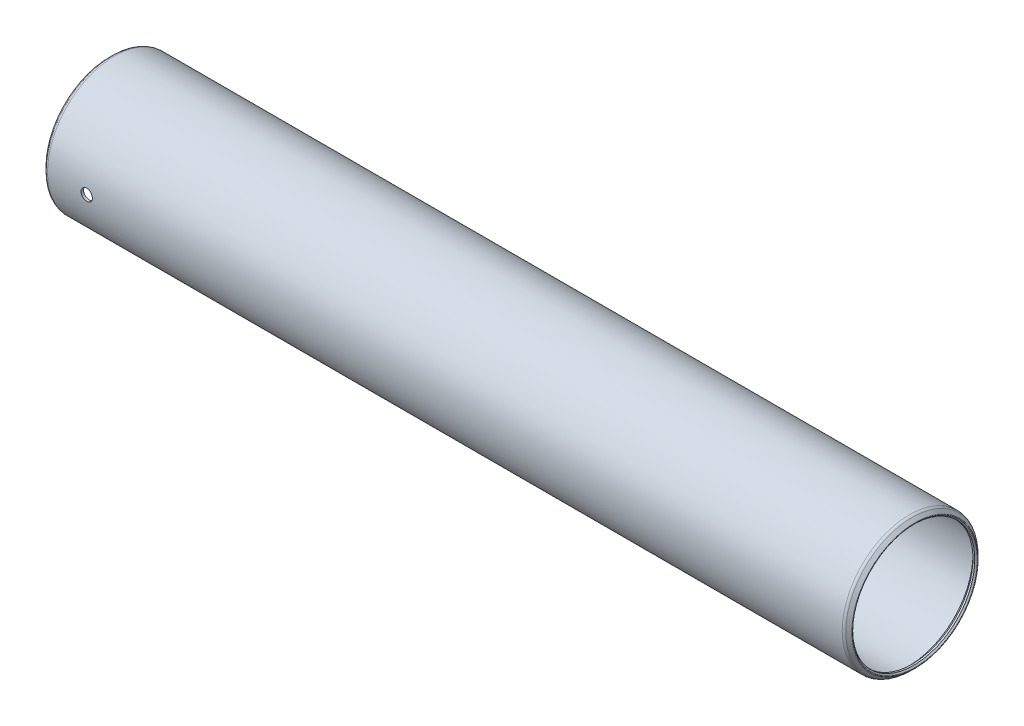
ISO-10303-21;
HEADER;
FILE_DESCRIPTION(('STEP AP214'),'2;1');
FILE_NAME('part.step','',(''),(''),'','','');
FILE_SCHEMA(('AUTOMOTIVE_DESIGN { 1 0 10303 214 1 1 1 1 }'));
ENDSEC;
DATA;
#1=APPLICATION_CONTEXT('core data for automotive mechanical design processes');
#2=APPLICATION_PROTOCOL_DEFINITION('international standard','automotive_design',2000,#1);
#3=PRODUCT_CONTEXT('',#1,'mechanical');
#4=PRODUCT('Part','Part','',(#3));
#5=PRODUCT_RELATED_PRODUCT_CATEGORY('part','',(#4));
#6=PRODUCT_DEFINITION_FORMATION('','',#4);
#7=PRODUCT_DEFINITION_CONTEXT('part definition',#1,'design');
#8=PRODUCT_DEFINITION('design','',#6,#7);
#9=PRODUCT_DEFINITION_SHAPE('','',#8);
#10=(LENGTH_UNIT() NAMED_UNIT(*) SI_UNIT(.MILLI.,.METRE.));
#11=(NAMED_UNIT(*) PLANE_ANGLE_UNIT() SI_UNIT($,.RADIAN.));
#12=(NAMED_UNIT(*) SI_UNIT($,.STERADIAN.) SOLID_ANGLE_UNIT());
#13=UNCERTAINTY_MEASURE_WITH_UNIT(LENGTH_MEASURE(1.E-05),#10,'distance_accuracy_value','');
#14=(GEOMETRIC_REPRESENTATION_CONTEXT(3) GLOBAL_UNCERTAINTY_ASSIGNED_CONTEXT((#13)) GLOBAL_UNIT_ASSIGNED_CONTEXT((#10,
#11,#12)) REPRESENTATION_CONTEXT('',''));
#15=CARTESIAN_POINT('',(0.,0.,0.));
#16=DIRECTION('',(0.,0.,1.));
#17=DIRECTION('',(1.,0.,0.));
#18=AXIS2_PLACEMENT_3D('',#15,#16,#17);
#19=CARTESIAN_POINT('',(168.1734,0.,0.));
#20=DIRECTION('',(-1.,0.,0.));
#21=DIRECTION('',(0.,0.,1.));
#22=AXIS2_PLACEMENT_3D('',#19,#20,#21);
#23=CYLINDRICAL_SURFACE('',#22,13.60805);
#24=CARTESIAN_POINT('',(0.762000000000013,0.,0.));
#25=DIRECTION('',(-1.,0.,0.));
#26=DIRECTION('',(0.,0.,1.));
#27=AXIS2_PLACEMENT_3D('',#24,#25,#26);
#28=CIRCLE('',#27,13.60805);
#29=CARTESIAN_POINT('',(0.762000000000013,0.,13.60805));
#30=VERTEX_POINT('',#29);
#31=EDGE_CURVE('E56',#30,#30,#28,.T.);
#32=ORIENTED_EDGE('',*,*,#31,.T.);
#33=EDGE_LOOP('',(#32));
#34=FACE_BOUND('',#33,.T.);
#35=CARTESIAN_POINT('',(167.4114,0.,0.));
#36=DIRECTION('',(-1.,0.,0.));
#37=DIRECTION('',(0.,0.,1.));
#38=AXIS2_PLACEMENT_3D('',#35,#36,#37);
#39=CIRCLE('',#38,13.60805);
#40=CARTESIAN_POINT('',(167.4114,0.,13.60805));
#41=VERTEX_POINT('',#40);
#42=EDGE_CURVE('E59',#41,#41,#39,.T.);
#43=ORIENTED_EDGE('',*,*,#42,.F.);
#44=EDGE_LOOP('',(#43));
#45=FACE_BOUND('',#44,.T.);
#46=CARTESIAN_POINT('',(9.95679999999999,0.,13.60805));
#47=CARTESIAN_POINT('',(9.95679708301893,-0.0669182546482718,13.608049316548));
#48=CARTESIAN_POINT('',(9.95115443233959,-0.133881741871162,13.6075511313661));
#49=CARTESIAN_POINT('',(9.92872838455429,-0.265955050546539,13.6056116722791));
#50=CARTESIAN_POINT('',(9.91193245128793,-0.331062700079983,13.6041693371863));
#51=CARTESIAN_POINT('',(9.8676900846028,-0.457492452892775,13.600504525612));
#52=CARTESIAN_POINT('',(9.84024977771192,-0.518816710269826,13.5982824979641));
#53=CARTESIAN_POINT('',(9.77550878988491,-0.635974564806711,13.5933073106333));
#54=CARTESIAN_POINT('',(9.73821018149235,-0.691809312663339,13.5905542626213));
#55=CARTESIAN_POINT('',(9.65469848449648,-0.7965743137312,13.5848171871262));
#56=CARTESIAN_POINT('',(9.60846341826353,-0.845487018835931,13.5818326012789));
#57=CARTESIAN_POINT('',(9.50843782103866,-0.934868846378991,13.5759734995207));
#58=CARTESIAN_POINT('',(9.4546469541021,-0.975337593184628,13.5730989885111));
#59=CARTESIAN_POINT('',(9.34092941918919,-1.04674292044388,13.5677795828556));
#60=CARTESIAN_POINT('',(9.280992951096,-1.07766395049416,13.565335391827));
#61=CARTESIAN_POINT('',(9.1567538010192,-1.12899678917914,13.5611599143374));
#62=CARTESIAN_POINT('',(9.09245120371227,-1.14940880155976,13.5594286140552));
#63=CARTESIAN_POINT('',(8.96148184852376,-1.17909296626753,13.5568797393416));
#64=CARTESIAN_POINT('',(8.8948216509038,-1.18839385737639,13.5560598080495));
#65=CARTESIAN_POINT('',(8.76088164230416,-1.19568055751461,13.5554190966986));
#66=CARTESIAN_POINT('',(8.69360184412538,-1.19366659978648,13.555598296044));
#67=CARTESIAN_POINT('',(8.56052969101664,-1.17840450616186,13.5569334538123));
#68=CARTESIAN_POINT('',(8.49473371875241,-1.16518763914177,13.5580866935214));
#69=CARTESIAN_POINT('',(8.36629761654667,-1.12794350298004,13.5612357313031));
#70=CARTESIAN_POINT('',(8.30365752035618,-1.10391611825092,13.5632315383846));
#71=CARTESIAN_POINT('',(8.18321185861607,-1.04569810788095,13.5678439633093));
#72=CARTESIAN_POINT('',(8.12541308946077,-1.0114934917358,13.5704614347403));
#73=CARTESIAN_POINT('',(8.01636511195066,-0.933902039337988,13.5760214947568));
#74=CARTESIAN_POINT('',(7.96511605083599,-0.890514996718806,13.5789640906484));
#75=CARTESIAN_POINT('',(7.87044047693493,-0.795615092475709,13.5848549435303));
#76=CARTESIAN_POINT('',(7.82704104819841,-0.744075205315693,13.5878031859359));
#77=CARTESIAN_POINT('',(7.74950622419902,-0.634426816025969,13.5933636651988));
#78=CARTESIAN_POINT('',(7.71537083604385,-0.576318308856631,13.5959759017984));
#79=CARTESIAN_POINT('',(7.65733461000234,-0.455164276524883,13.6005706231754));
#80=CARTESIAN_POINT('',(7.63343501463544,-0.392118153085045,13.6025530314905));
#81=CARTESIAN_POINT('',(7.5965679764888,-0.262886805098121,13.6056638839094));
#82=CARTESIAN_POINT('',(7.58360028224248,-0.19670165279513,13.6067923476564));
#83=CARTESIAN_POINT('',(7.56899920769066,-0.0633057084379337,13.6080656427365));
#84=CARTESIAN_POINT('',(7.5673284262197,0.00390096014763285,13.6082137198431));
#85=CARTESIAN_POINT('',(7.57527056376644,0.137638382320868,13.6075182347554));
#86=CARTESIAN_POINT('',(7.58488336595981,0.204169142899341,13.6066746828279));
#87=CARTESIAN_POINT('',(7.61508879198431,0.334559219682892,13.6040928727499));
#88=CARTESIAN_POINT('',(7.63566403643894,0.398422592305757,13.6023560309328));
#89=CARTESIAN_POINT('',(7.68719251361759,0.521790806302529,13.5981826863816));
#90=CARTESIAN_POINT('',(7.71814592753115,0.581295571558635,13.5957461714322));
#91=CARTESIAN_POINT('',(7.78964577513802,0.694427383789486,13.5904383750868));
#92=CARTESIAN_POINT('',(7.83021693615533,0.748038749909508,13.5875659800053));
#93=CARTESIAN_POINT('',(7.91976495742896,0.847703536830346,13.5817127326722));
#94=CARTESIAN_POINT('',(7.96874197958377,0.893756812027454,13.5787318783325));
#95=CARTESIAN_POINT('',(8.07387396535874,0.977126813007208,13.5729880250846));
#96=CARTESIAN_POINT('',(8.13004834977849,1.01441909752546,13.5702256495799));
#97=CARTESIAN_POINT('',(8.24788402429577,1.07904083433481,13.5652405289984));
#98=CARTESIAN_POINT('',(8.30954525454217,1.10637039528381,13.5630177780363));
#99=CARTESIAN_POINT('',(8.43651841293467,1.15024944112672,13.559367185593));
#100=CARTESIAN_POINT('',(8.50182517357792,1.1668137844106,13.5579382488695));
#101=CARTESIAN_POINT('',(8.63430609227215,1.18874053042524,13.5560334832072));
#102=CARTESIAN_POINT('',(8.70148021010278,1.19410317423634,13.5555576337563));
#103=CARTESIAN_POINT('',(8.83554611693338,1.19347137557144,13.5556132553957));
#104=CARTESIAN_POINT('',(8.90243809165198,1.18751533298986,13.5561413205969));
#105=CARTESIAN_POINT('',(9.03426766120116,1.1644954120055,13.5581380294439));
#106=CARTESIAN_POINT('',(9.09920525322321,1.14743151764102,13.5596066744412));
#107=CARTESIAN_POINT('',(9.22528451287958,1.10269022427221,13.5633181559878));
#108=CARTESIAN_POINT('',(9.2864264674737,1.07501362875311,13.5655609339264));
#109=CARTESIAN_POINT('',(9.40320259425023,1.00983676557016,13.5705680835019));
#110=CARTESIAN_POINT('',(9.45883683910169,0.972336627542543,13.5733324482555));
#111=CARTESIAN_POINT('',(9.56321493671497,0.888432807982477,13.5790824775698));
#112=CARTESIAN_POINT('',(9.61193584490628,0.842000630023597,13.5820688311231));
#113=CARTESIAN_POINT('',(9.70091338867967,0.741603984891418,13.5879200468851));
#114=CARTESIAN_POINT('',(9.74116797861839,0.6876377025462,13.5907848795984));
#115=CARTESIAN_POINT('',(9.81213036633629,0.573589955763267,13.5960759911951));
#116=CARTESIAN_POINT('',(9.84281871286696,0.513496357359421,13.5985013723954));
#117=CARTESIAN_POINT('',(9.89362986284665,0.389028363158872,13.6026300080547));
#118=CARTESIAN_POINT('',(9.91376475422052,0.324658960547063,13.6043340882591));
#119=CARTESIAN_POINT('',(9.93779579646115,0.216594595648881,13.6063929318442));
#120=CARTESIAN_POINT('',(9.94491283573995,0.17359363107121,13.6070114866693));
#121=CARTESIAN_POINT('',(9.95441587945564,0.0870681605825597,13.6078402424959));
#122=CARTESIAN_POINT('',(9.95680189807731,0.0435436562416746,13.6080504447217));
#123=CARTESIAN_POINT('',(9.95679999999999,0.,13.60805));
#124=B_SPLINE_CURVE_WITH_KNOTS('',3,(#46,#47,#48,#49,#50,#51,#52,#53,#54,#55,#56,#57,#58,#59,
#60,#61,#62,#63,#64,#65,#66,#67,#68,#69,#70,#71,#72,#73,#74,#75,#76,#77,#78,#79,#80,#81,#82,#83,
#84,#85,#86,#87,#88,#89,#90,#91,#92,#93,#94,#95,#96,#97,#98,#99,#100,#101,#102,#103,#104,#105,
#106,#107,#108,#109,#110,#111,#112,#113,#114,#115,#116,#117,#118,#119,#120,#121,#122,#123),
.UNSPECIFIED.,.T.,.F.,(4,2,2,2,2,2,2,2,2,2,2,2,2,2,2,2,2,2,2,2,2,2,2,2,2,2,2,2,2,2,2,2,2,2,2,2,
2,2,4),(0.,0.200595776364208,0.401417402555722,0.602123613959344,0.802787663743492,
1.00395163894922,1.20512456110373,1.40662342685356,1.60811838585192,1.80909104431727,
2.01005955997897,2.21046898470325,2.41088055228259,2.61156890595591,2.81226177039288,
3.01363441008906,3.21500720428504,3.41640443613274,3.61779703511228,3.81852254723748,
4.0192459811741,4.21965213971364,4.42006179727014,4.62099240769906,4.82192688852443,
5.02341544728019,5.22490180844603,5.42610947975998,5.62731282068517,5.82783477543159,
6.02835701832368,6.22886408271802,6.42936850125701,6.63052354054656,6.83172712749546,
7.03333719694748,7.23471583483494,7.36524374182047,7.49577125745047),.UNSPECIFIED.);
#125=CARTESIAN_POINT('',(9.95679999999999,0.,13.60805));
#126=VERTEX_POINT('',#125);
#127=EDGE_CURVE('E89',#126,#126,#124,.T.);
#128=ORIENTED_EDGE('',*,*,#127,.F.);
#129=EDGE_LOOP('',(#128));
#130=FACE_BOUND('',#129,.T.);
#131=ADVANCED_FACE('F32',(#34,#45,#130),#23,.F.);
#132=CARTESIAN_POINT('',(168.1734,0.,0.));
#133=DIRECTION('',(-1.,0.,0.));
#134=DIRECTION('',(0.,0.,1.));
#135=AXIS2_PLACEMENT_3D('',#132,#133,#134);
#136=CYLINDRICAL_SURFACE('',#135,14.1351000000001);
#137=CARTESIAN_POINT('',(0.527049999997864,0.,0.));
#138=DIRECTION('',(-1.,0.,0.));
#139=DIRECTION('',(0.,0.,1.));
#140=AXIS2_PLACEMENT_3D('',#137,#138,#139);
#141=CIRCLE('',#140,14.1351000000002);
#142=CARTESIAN_POINT('',(0.527049999997864,0.,14.1351000000002));
#143=VERTEX_POINT('',#142);
#144=EDGE_CURVE('E80',#143,#143,#141,.T.);
#145=ORIENTED_EDGE('',*,*,#144,.F.);
#146=EDGE_LOOP('',(#145));
#147=FACE_BOUND('',#146,.T.);
#148=CARTESIAN_POINT('',(167.64635,0.,0.));
#149=DIRECTION('',(-1.,0.,0.));
#150=DIRECTION('',(0.,0.,1.));
#151=AXIS2_PLACEMENT_3D('',#148,#149,#150);
#152=CIRCLE('',#151,14.1351);
#153=CARTESIAN_POINT('',(167.64635,0.,14.1351));
#154=VERTEX_POINT('',#153);
#155=EDGE_CURVE('E77',#154,#154,#152,.T.);
#156=ORIENTED_EDGE('',*,*,#155,.T.);
#157=EDGE_LOOP('',(#156));
#158=FACE_BOUND('',#157,.T.);
#159=CARTESIAN_POINT('',(7.5692,0.,14.1351000000001));
#160=CARTESIAN_POINT('',(7.56920292181596,-0.0669283271261537,14.1350993401613));
#161=CARTESIAN_POINT('',(7.57484726399437,-0.133902135301032,14.1346195848797));
#162=CARTESIAN_POINT('',(7.59728042319043,-0.265996491031899,14.1327518733434));
#163=CARTESIAN_POINT('',(7.6140818446467,-0.331114855572767,14.1313628899357));
#164=CARTESIAN_POINT('',(7.65833963765327,-0.457566086300831,14.1278336735271));
#165=CARTESIAN_POINT('',(7.68578995527623,-0.518901080423648,14.1256938674369));
#166=CARTESIAN_POINT('',(7.75055543839332,-0.636078307307289,14.1209029302644));
#167=CARTESIAN_POINT('',(7.78786850294063,-0.691921706407142,14.1182519081131));
#168=CARTESIAN_POINT('',(7.87140556793543,-0.796691100327122,14.1127282376207));
#169=CARTESIAN_POINT('',(7.91765002219988,-0.845600761572882,14.1098550898243));
#170=CARTESIAN_POINT('',(8.01769391089028,-0.934974155924522,14.1042151767762));
#171=CARTESIAN_POINT('',(8.07149367808737,-0.975437516820743,14.1014484162172));
#172=CARTESIAN_POINT('',(8.18522013921747,-1.04682516542564,14.0963291859554));
#173=CARTESIAN_POINT('',(8.24515589291445,-1.07773506898988,14.0939773432358));
#174=CARTESIAN_POINT('',(8.36938985270397,-1.12904650202632,14.0899599818292));
#175=CARTESIAN_POINT('',(8.4336879798337,-1.14944822164851,14.0882944507232));
#176=CARTESIAN_POINT('',(8.56465764061446,-1.17911671021048,14.0858425083406));
#177=CARTESIAN_POINT('',(8.63132309864346,-1.18841012291819,14.0850539938179));
#178=CARTESIAN_POINT('',(8.76527196549843,-1.19568050509525,14.08443872305));
#179=CARTESIAN_POINT('',(8.83255536241638,-1.19365769217976,14.0846119483101));
#180=CARTESIAN_POINT('',(8.96564752296844,-1.17837506017275,14.0858986730767));
#181=CARTESIAN_POINT('',(9.03145963928094,-1.1651442060237,14.0870097488695));
#182=CARTESIAN_POINT('',(9.15992568462764,-1.12786607104217,14.0900431828304));
#183=CARTESIAN_POINT('',(9.22257958207598,-1.10381868205565,14.0919655491105));
#184=CARTESIAN_POINT('',(9.34304293012354,-1.04555769253766,14.0964077496589));
#185=CARTESIAN_POINT('',(9.40084607074475,-1.01133110566503,14.0989283462983));
#186=CARTESIAN_POINT('',(9.50989807835045,-0.933692647803003,14.1042822979228));
#187=CARTESIAN_POINT('',(9.56114680890691,-0.890280585670664,14.1071156594156));
#188=CARTESIAN_POINT('',(9.65580364295232,-0.795341071971393,14.1127866730801));
#189=CARTESIAN_POINT('',(9.69918663747083,-0.743788581375684,14.1156243108149));
#190=CARTESIAN_POINT('',(9.77668634820717,-0.634118926305164,14.1209756782483));
#191=CARTESIAN_POINT('',(9.81080305801055,-0.576001757286086,14.1234894077226));
#192=CARTESIAN_POINT('',(9.86880022219154,-0.454836092003784,14.1279102278279));
#193=CARTESIAN_POINT('',(9.89267955450346,-0.391787056079348,14.129817251955));
#194=CARTESIAN_POINT('',(9.92950648637397,-0.262554923079167,14.1328090346272));
#195=CARTESIAN_POINT('',(9.94245431896717,-0.196371892844793,14.1338938107005));
#196=CARTESIAN_POINT('',(9.95701920600603,-0.0629680933603935,14.1351166222717));
#197=CARTESIAN_POINT('',(9.95867094036536,0.00424886415003661,14.1352575554142));
#198=CARTESIAN_POINT('',(9.95068760810625,0.138003690936403,14.1345845426698));
#199=CARTESIAN_POINT('',(9.94105264966805,0.204541566715009,14.1337706059351));
#200=CARTESIAN_POINT('',(9.91079817844433,0.334950504129664,14.1312812487311));
#201=CARTESIAN_POINT('',(9.89019475037927,0.398825323483857,14.1296070898601));
#202=CARTESIAN_POINT('',(9.83860463060446,0.522211400617719,14.1255853425754));
#203=CARTESIAN_POINT('',(9.80761777042593,0.581722587579367,14.1232377432352));
#204=CARTESIAN_POINT('',(9.73605330986646,0.694849853689599,14.1181250228165));
#205=CARTESIAN_POINT('',(9.69545274639488,0.748451360742454,14.1153589078815));
#206=CARTESIAN_POINT('',(9.60584653631726,0.848090595113093,14.1097232324076));
#207=CARTESIAN_POINT('',(9.55684073971241,0.894128187417422,14.1068536700233));
#208=CARTESIAN_POINT('',(9.45166461794951,0.977451800981743,14.1013259313808));
#209=CARTESIAN_POINT('',(9.39547632423666,1.01471518341474,14.098668313394));
#210=CARTESIAN_POINT('',(9.27761957894872,1.07927735451325,14.0938733119402));
#211=CARTESIAN_POINT('',(9.21595118336847,1.10657624497985,14.0917359231583));
#212=CARTESIAN_POINT('',(9.08896477896685,1.15039599483741,14.0882265385032));
#213=CARTESIAN_POINT('',(9.02365157231614,1.16693068869567,14.0868535605165));
#214=CARTESIAN_POINT('',(8.89116384521411,1.18879771905824,14.0850251790499));
#215=CARTESIAN_POINT('',(8.82398936161352,1.19413027718917,14.0845697574168));
#216=CARTESIAN_POINT('',(8.68991090470376,1.1934390725901,14.0846283256226));
#217=CARTESIAN_POINT('',(8.62300674382314,1.1874508799686,14.0851392790867));
#218=CARTESIAN_POINT('',(8.4911579962589,1.16436235213308,14.0870665729208));
#219=CARTESIAN_POINT('',(8.42621341252206,1.14726200020965,14.0884829146524));
#220=CARTESIAN_POINT('',(8.30012520184655,1.10244363127395,14.0920605969998));
#221=CARTESIAN_POINT('',(8.23898133647736,1.07472628108087,14.0942218908268));
#222=CARTESIAN_POINT('',(8.12220888360784,1.00946467384947,14.0990460309782));
#223=CARTESIAN_POINT('',(8.06658021301955,0.971920564885074,14.1017088697448));
#224=CARTESIAN_POINT('',(7.962235186184,0.887937513679703,14.1072460196813));
#225=CARTESIAN_POINT('',(7.91354007085993,0.841472220861158,14.1101209413924));
#226=CARTESIAN_POINT('',(7.82462008071477,0.741013935895548,14.1157527492686));
#227=CARTESIAN_POINT('',(7.78439725693728,0.687019126185856,14.1185096067233));
#228=CARTESIAN_POINT('',(7.71350817019649,0.572927772140122,14.1235997666304));
#229=CARTESIAN_POINT('',(7.68286022000887,0.512819823292393,14.1259322539244));
#230=CARTESIAN_POINT('',(7.63213124684047,0.388332241258137,14.1299013567545));
#231=CARTESIAN_POINT('',(7.61203809165175,0.323957608729382,14.131538770825));
#232=CARTESIAN_POINT('',(7.58809979422027,0.216003457892249,14.1335134371225));
#233=CARTESIAN_POINT('',(7.58102180785904,0.173117960922013,14.1341056856219));
#234=CARTESIAN_POINT('',(7.57157096934717,0.0868280234485226,14.1348991805791));
#235=CARTESIAN_POINT('',(7.5691981043046,0.043423584367487,14.1351004281083));
#236=CARTESIAN_POINT('',(7.5692,0.,14.1351000000001));
#237=B_SPLINE_CURVE_WITH_KNOTS('',3,(#159,#160,#161,#162,#163,#164,#165,#166,#167,#168,#169,
#170,#171,#172,#173,#174,#175,#176,#177,#178,#179,#180,#181,#182,#183,#184,#185,#186,#187,#188,
#189,#190,#191,#192,#193,#194,#195,#196,#197,#198,#199,#200,#201,#202,#203,#204,#205,#206,#207,
#208,#209,#210,#211,#212,#213,#214,#215,#216,#217,#218,#219,#220,#221,#222,#223,#224,#225,#226,
#227,#228,#229,#230,#231,#232,#233,#234,#235,#236),.UNSPECIFIED.,.T.,.F.,(4,2,2,2,2,2,2,2,2,2,2,
2,2,2,2,2,2,2,2,2,2,2,2,2,2,2,2,2,2,2,2,2,2,2,2,2,2,2,4),(0.,0.200626436393935,
0.401479912090746,0.60221936896414,0.80291609904774,1.00407801556242,1.20524879496448,
1.40672100759489,1.60818957437337,1.80917393388867,2.01015442841468,2.21061710799124,
2.41108179202985,2.61180332856396,2.81252904237544,3.01388464415477,3.21524038531934,
3.41661819040051,3.61799170245818,3.81874670329254,4.01949977995424,4.21995926979817,
4.42042201220841,4.62136849367328,4.82231856157891,5.02378156560598,5.2252425113519,
5.42644401960252,5.62764154718096,5.82820795709324,6.02877466859883,6.22932878522544,
6.42987987998819,6.63103271998156,6.83223420091932,7.03381817408425,7.23516992672128,
7.36533817134602,7.49550605931189),.UNSPECIFIED.);
#238=CARTESIAN_POINT('',(7.5692,0.,14.1351000000001));
#239=VERTEX_POINT('',#238);
#240=EDGE_CURVE('E10',#239,#239,#237,.T.);
#241=ORIENTED_EDGE('',*,*,#240,.F.);
#242=EDGE_LOOP('',(#241));
#243=FACE_BOUND('',#242,.T.);
#244=ADVANCED_FACE('F110',(#147,#158,#243),#136,.T.);
#245=CARTESIAN_POINT('',(-0.549710244842028,0.,0.));
#246=DIRECTION('',(-1.,0.,0.));
#247=DIRECTION('',(0.,0.,1.));
#248=AXIS2_PLACEMENT_3D('',#245,#246,#247);
#249=TOROIDAL_SURFACE('',#248,13.194365367264,0.127000000000741);
#250=CARTESIAN_POINT('',(-0.639512806053455,0.,0.));
#251=DIRECTION('',(-1.,0.,0.));
#252=DIRECTION('',(0.,0.,1.));
#253=AXIS2_PLACEMENT_3D('',#250,#251,#252);
#254=CIRCLE('',#253,13.104562806053);
#255=CARTESIAN_POINT('',(-0.639512806053455,0.,13.104562806053));
#256=VERTEX_POINT('',#255);
#257=EDGE_CURVE('E43',#256,#256,#254,.T.);
#258=ORIENTED_EDGE('',*,*,#257,.F.);
#259=EDGE_LOOP('',(#258));
#260=FACE_BOUND('',#259,.T.);
#261=CARTESIAN_POINT('',(-0.639512806053455,0.,0.));
#262=DIRECTION('',(-1.,0.,0.));
#263=DIRECTION('',(0.,0.,1.));
#264=AXIS2_PLACEMENT_3D('',#261,#262,#263);
#265=CIRCLE('',#264,13.284167928475);
#266=CARTESIAN_POINT('',(-0.639512806053455,0.,13.284167928475));
#267=VERTEX_POINT('',#266);
#268=EDGE_CURVE('E86',#267,#267,#265,.T.);
#269=ORIENTED_EDGE('',*,*,#268,.T.);
#270=EDGE_LOOP('',(#269));
#271=FACE_BOUND('',#270,.T.);
#272=ADVANCED_FACE('F34',(#260,#271),#249,.T.);
#273=CARTESIAN_POINT('',(-0.639512806053455,0.,0.));
#274=DIRECTION('',(-1.,0.,0.));
#275=DIRECTION('',(0.,0.,1.));
#276=AXIS2_PLACEMENT_3D('',#273,#274,#275);
#277=CONICAL_SURFACE('',#276,13.104562806053,0.785398163396556);
#278=CARTESIAN_POINT('',(-0.380999999999992,0.,0.));
#279=DIRECTION('',(-1.,0.,0.));
#280=DIRECTION('',(0.,0.,1.));
#281=AXIS2_PLACEMENT_3D('',#278,#279,#280);
#282=CIRCLE('',#281,12.84605);
#283=CARTESIAN_POINT('',(-0.380999999999992,0.,12.84605));
#284=VERTEX_POINT('',#283);
#285=EDGE_CURVE('E47',#284,#284,#282,.T.);
#286=ORIENTED_EDGE('',*,*,#285,.F.);
#287=EDGE_LOOP('',(#286));
#288=FACE_BOUND('',#287,.T.);
#289=ORIENTED_EDGE('',*,*,#257,.T.);
#290=EDGE_LOOP('',(#289));
#291=FACE_BOUND('',#290,.T.);
#292=ADVANCED_FACE('F159',(#288,#291),#277,.F.);
#293=CARTESIAN_POINT('',(168.1734,0.,0.));
#294=DIRECTION('',(-1.,0.,0.));
#295=DIRECTION('',(0.,0.,1.));
#296=AXIS2_PLACEMENT_3D('',#293,#294,#295);
#297=CYLINDRICAL_SURFACE('',#296,12.84605);
#298=CARTESIAN_POINT('',(0.,0.,0.));
#299=DIRECTION('',(-1.,0.,0.));
#300=DIRECTION('',(0.,0.,1.));
#301=AXIS2_PLACEMENT_3D('',#298,#299,#300);
#302=CIRCLE('',#301,12.84605);
#303=CARTESIAN_POINT('',(0.,0.,12.84605));
#304=VERTEX_POINT('',#303);
#305=EDGE_CURVE('E51',#304,#304,#302,.T.);
#306=ORIENTED_EDGE('',*,*,#305,.F.);
#307=EDGE_LOOP('',(#306));
#308=FACE_BOUND('',#307,.T.);
#309=ORIENTED_EDGE('',*,*,#285,.T.);
#310=EDGE_LOOP('',(#309));
#311=FACE_BOUND('',#310,.T.);
#312=ADVANCED_FACE('F140',(#308,#311),#297,.F.);
#313=CARTESIAN_POINT('',(0.,0.,0.));
#314=DIRECTION('',(1.,0.,0.));
#315=DIRECTION('',(0.,0.,-1.));
#316=AXIS2_PLACEMENT_3D('',#313,#314,#315);
#317=CONICAL_SURFACE('',#316,12.84605,0.78539816339744);
#318=ORIENTED_EDGE('',*,*,#31,.F.);
#319=EDGE_LOOP('',(#318));
#320=FACE_BOUND('',#319,.T.);
#321=ORIENTED_EDGE('',*,*,#305,.T.);
#322=EDGE_LOOP('',(#321));
#323=FACE_BOUND('',#322,.T.);
#324=ADVANCED_FACE('F135',(#320,#323),#317,.F.);
#325=CARTESIAN_POINT('',(167.4114,0.,0.));
#326=DIRECTION('',(-1.,0.,0.));
#327=DIRECTION('',(0.,0.,1.));
#328=AXIS2_PLACEMENT_3D('',#325,#326,#327);
#329=CONICAL_SURFACE('',#328,13.60805,0.78539816339744);
#330=CARTESIAN_POINT('',(168.1734,0.,0.));
#331=DIRECTION('',(-1.,0.,0.));
#332=DIRECTION('',(0.,0.,1.));
#333=AXIS2_PLACEMENT_3D('',#330,#331,#332);
#334=CIRCLE('',#333,12.84605);
#335=CARTESIAN_POINT('',(168.1734,0.,12.84605));
#336=VERTEX_POINT('',#335);
#337=EDGE_CURVE('E62',#336,#336,#334,.T.);
#338=ORIENTED_EDGE('',*,*,#337,.F.);
#339=EDGE_LOOP('',(#338));
#340=FACE_BOUND('',#339,.T.);
#341=ORIENTED_EDGE('',*,*,#42,.T.);
#342=EDGE_LOOP('',(#341));
#343=FACE_BOUND('',#342,.T.);
#344=ADVANCED_FACE('F132',(#340,#343),#329,.F.);
#345=CARTESIAN_POINT('',(168.1734,0.,0.));
#346=DIRECTION('',(-1.,0.,0.));
#347=DIRECTION('',(0.,0.,1.));
#348=AXIS2_PLACEMENT_3D('',#345,#346,#347);
#349=CYLINDRICAL_SURFACE('',#348,12.84605);
#350=CARTESIAN_POINT('',(168.5544,0.,0.));
#351=DIRECTION('',(-1.,0.,0.));
#352=DIRECTION('',(0.,0.,1.));
#353=AXIS2_PLACEMENT_3D('',#350,#351,#352);
#354=CIRCLE('',#353,12.84605);
#355=CARTESIAN_POINT('',(168.5544,0.,12.84605));
#356=VERTEX_POINT('',#355);
#357=EDGE_CURVE('E65',#356,#356,#354,.T.);
#358=ORIENTED_EDGE('',*,*,#357,.F.);
#359=EDGE_LOOP('',(#358));
#360=FACE_BOUND('',#359,.T.);
#361=ORIENTED_EDGE('',*,*,#337,.T.);
#362=EDGE_LOOP('',(#361));
#363=FACE_BOUND('',#362,.T.);
#364=ADVANCED_FACE('F129',(#360,#363),#349,.F.);
#365=CARTESIAN_POINT('',(168.5544,0.,0.));
#366=DIRECTION('',(1.,0.,0.));
#367=DIRECTION('',(0.,0.,-1.));
#368=AXIS2_PLACEMENT_3D('',#365,#366,#367);
#369=CONICAL_SURFACE('',#368,12.84605,0.785398163397297);
#370=CARTESIAN_POINT('',(168.812912806052,0.,0.));
#371=DIRECTION('',(-1.,0.,0.));
#372=DIRECTION('',(0.,0.,1.));
#373=AXIS2_PLACEMENT_3D('',#370,#371,#372);
#374=CIRCLE('',#373,13.1045628060515);
#375=CARTESIAN_POINT('',(168.812912806052,0.,13.1045628060515));
#376=VERTEX_POINT('',#375);
#377=EDGE_CURVE('E68',#376,#376,#374,.T.);
#378=ORIENTED_EDGE('',*,*,#377,.F.);
#379=EDGE_LOOP('',(#378));
#380=FACE_BOUND('',#379,.T.);
#381=ORIENTED_EDGE('',*,*,#357,.T.);
#382=EDGE_LOOP('',(#381));
#383=FACE_BOUND('',#382,.T.);
#384=ADVANCED_FACE('F125',(#380,#383),#369,.F.);
#385=CARTESIAN_POINT('',(168.723110244842,0.,0.));
#386=DIRECTION('',(-1.,0.,0.));
#387=DIRECTION('',(0.,0.,1.));
#388=AXIS2_PLACEMENT_3D('',#385,#386,#387);
#389=TOROIDAL_SURFACE('',#388,13.1943653672621,0.126999999999104);
#390=CARTESIAN_POINT('',(168.812912806052,0.,0.));
#391=DIRECTION('',(-1.,0.,0.));
#392=DIRECTION('',(0.,0.,1.));
#393=AXIS2_PLACEMENT_3D('',#390,#391,#392);
#394=CIRCLE('',#393,13.2841679284724);
#395=CARTESIAN_POINT('',(168.812912806052,0.,13.2841679284724));
#396=VERTEX_POINT('',#395);
#397=EDGE_CURVE('E71',#396,#396,#394,.T.);
#398=ORIENTED_EDGE('',*,*,#397,.F.);
#399=EDGE_LOOP('',(#398));
#400=FACE_BOUND('',#399,.T.);
#401=ORIENTED_EDGE('',*,*,#377,.T.);
#402=EDGE_LOOP('',(#401));
#403=FACE_BOUND('',#402,.T.);
#404=ADVANCED_FACE('F121',(#400,#403),#389,.T.);
#405=CARTESIAN_POINT('',(168.812912806052,0.,0.));
#406=DIRECTION('',(-1.,0.,0.));
#407=DIRECTION('',(0.,0.,1.));
#408=AXIS2_PLACEMENT_3D('',#405,#406,#407);
#409=CONICAL_SURFACE('',#408,13.2841679284724,0.78539816339736);
#410=CARTESIAN_POINT('',(168.185165367256,0.,0.));
#411=DIRECTION('',(-1.,0.,0.));
#412=DIRECTION('',(0.,0.,1.));
#413=AXIS2_PLACEMENT_3D('',#410,#411,#412);
#414=CIRCLE('',#413,13.9119153672685);
#415=CARTESIAN_POINT('',(168.185165367256,0.,13.9119153672685));
#416=VERTEX_POINT('',#415);
#417=EDGE_CURVE('E74',#416,#416,#414,.T.);
#418=ORIENTED_EDGE('',*,*,#417,.F.);
#419=EDGE_LOOP('',(#418));
#420=FACE_BOUND('',#419,.T.);
#421=ORIENTED_EDGE('',*,*,#397,.T.);
#422=EDGE_LOOP('',(#421));
#423=FACE_BOUND('',#422,.T.);
#424=ADVANCED_FACE('F117',(#420,#423),#409,.T.);
#425=CARTESIAN_POINT('',(167.646350000002,0.,0.));
#426=DIRECTION('',(-1.,0.,0.));
#427=DIRECTION('',(0.,0.,1.));
#428=AXIS2_PLACEMENT_3D('',#425,#426,#427);
#429=TOROIDAL_SURFACE('',#428,13.3731000000144,0.761999999985678);
#430=ORIENTED_EDGE('',*,*,#155,.F.);
#431=EDGE_LOOP('',(#430));
#432=FACE_BOUND('',#431,.T.);
#433=ORIENTED_EDGE('',*,*,#417,.T.);
#434=EDGE_LOOP('',(#433));
#435=FACE_BOUND('',#434,.T.);
#436=ADVANCED_FACE('F108',(#432,#435),#429,.T.);
#437=CARTESIAN_POINT('',(0.527049999998018,0.,0.));
#438=DIRECTION('',(-1.,0.,0.));
#439=DIRECTION('',(0.,0.,1.));
#440=AXIS2_PLACEMENT_3D('',#437,#438,#439);
#441=TOROIDAL_SURFACE('',#440,13.3731000000051,0.761999999995042);
#442=CARTESIAN_POINT('',(-0.0117653672626339,0.,0.));
#443=DIRECTION('',(-1.,0.,0.));
#444=DIRECTION('',(0.,0.,1.));
#445=AXIS2_PLACEMENT_3D('',#442,#443,#444);
#446=CIRCLE('',#445,13.9119153672658);
#447=CARTESIAN_POINT('',(-0.0117653672626339,0.,13.9119153672658));
#448=VERTEX_POINT('',#447);
#449=EDGE_CURVE('E83',#448,#448,#446,.T.);
#450=ORIENTED_EDGE('',*,*,#449,.F.);
#451=EDGE_LOOP('',(#450));
#452=FACE_BOUND('',#451,.T.);
#453=ORIENTED_EDGE('',*,*,#144,.T.);
#454=EDGE_LOOP('',(#453));
#455=FACE_BOUND('',#454,.T.);
#456=ADVANCED_FACE('F105',(#452,#455),#441,.T.);
#457=CARTESIAN_POINT('',(-0.0117653672626339,0.,0.));
#458=DIRECTION('',(1.,0.,0.));
#459=DIRECTION('',(0.,0.,-1.));
#460=AXIS2_PLACEMENT_3D('',#457,#458,#459);
#461=CONICAL_SURFACE('',#460,13.9119153672658,0.785398163397442);
#462=ORIENTED_EDGE('',*,*,#268,.F.);
#463=EDGE_LOOP('',(#462));
#464=FACE_BOUND('',#463,.T.);
#465=ORIENTED_EDGE('',*,*,#449,.T.);
#466=EDGE_LOOP('',(#465));
#467=FACE_BOUND('',#466,.T.);
#468=ADVANCED_FACE('F101',(#464,#467),#461,.T.);
#469=CARTESIAN_POINT('',(8.763,0.,14.1351));
#470=DIRECTION('',(0.,0.,-1.));
#471=DIRECTION('',(-1.,0.,0.));
#472=AXIS2_PLACEMENT_3D('',#469,#470,#471);
#473=CYLINDRICAL_SURFACE('',#472,1.1938);
#474=ORIENTED_EDGE('',*,*,#240,.T.);
#475=EDGE_LOOP('',(#474));
#476=FACE_BOUND('',#475,.T.);
#477=ORIENTED_EDGE('',*,*,#127,.T.);
#478=EDGE_LOOP('',(#477));
#479=FACE_BOUND('',#478,.T.);
#480=ADVANCED_FACE('F97',(#476,#479),#473,.F.);
#481=CLOSED_SHELL('',(#131,#244,#272,#292,#312,#324,#344,#364,#384,#404,#424,#436,#456,#468,#480));
#482=MANIFOLD_SOLID_BREP('B2',#481);
#483=ADVANCED_BREP_SHAPE_REPRESENTATION('',(#18,#482),#14);
#484=SHAPE_DEFINITION_REPRESENTATION(#9,#483);
ENDSEC;
END-ISO-10303-21;
